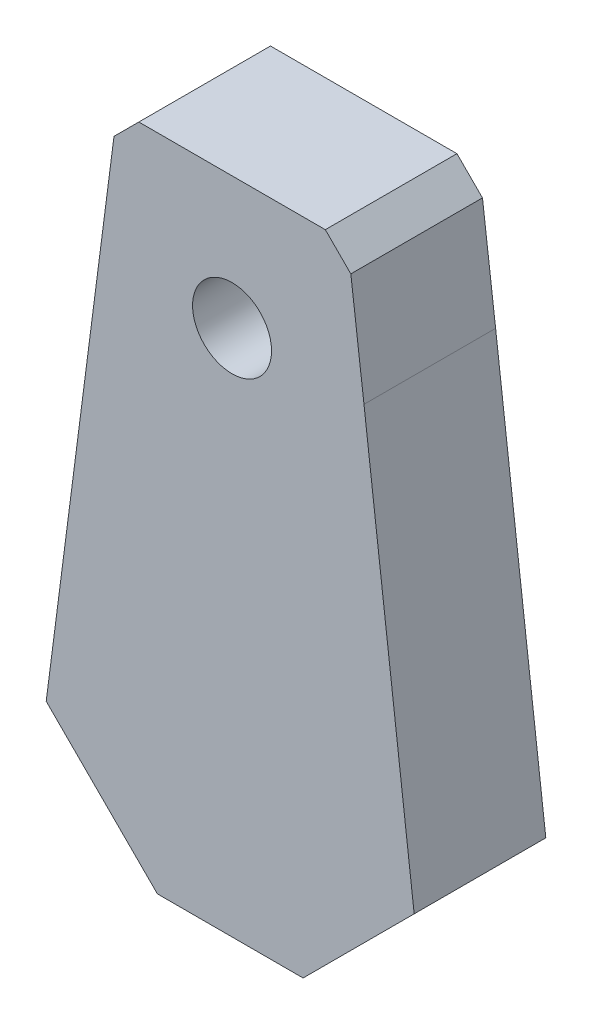
ISO-10303-21;
HEADER;
FILE_DESCRIPTION(('STEP AP214'),'2;1');
FILE_NAME('part.step','',(''),(''),'','','');
FILE_SCHEMA(('AUTOMOTIVE_DESIGN { 1 0 10303 214 1 1 1 1 }'));
ENDSEC;
DATA;
#1=APPLICATION_CONTEXT('core data for automotive mechanical design processes');
#2=APPLICATION_PROTOCOL_DEFINITION('international standard','automotive_design',2000,#1);
#3=PRODUCT_CONTEXT('',#1,'mechanical');
#4=PRODUCT('Part','Part','',(#3));
#5=PRODUCT_RELATED_PRODUCT_CATEGORY('part','',(#4));
#6=PRODUCT_DEFINITION_FORMATION('','',#4);
#7=PRODUCT_DEFINITION_CONTEXT('part definition',#1,'design');
#8=PRODUCT_DEFINITION('design','',#6,#7);
#9=PRODUCT_DEFINITION_SHAPE('','',#8);
#10=(LENGTH_UNIT() NAMED_UNIT(*) SI_UNIT(.MILLI.,.METRE.));
#11=(NAMED_UNIT(*) PLANE_ANGLE_UNIT() SI_UNIT($,.RADIAN.));
#12=(NAMED_UNIT(*) SI_UNIT($,.STERADIAN.) SOLID_ANGLE_UNIT());
#13=UNCERTAINTY_MEASURE_WITH_UNIT(LENGTH_MEASURE(1.E-05),#10,'distance_accuracy_value','');
#14=(GEOMETRIC_REPRESENTATION_CONTEXT(3) GLOBAL_UNCERTAINTY_ASSIGNED_CONTEXT((#13)) GLOBAL_UNIT_ASSIGNED_CONTEXT((#10,
#11,#12)) REPRESENTATION_CONTEXT('',''));
#15=CARTESIAN_POINT('',(0.,0.,0.));
#16=DIRECTION('',(0.,0.,1.));
#17=DIRECTION('',(1.,0.,0.));
#18=AXIS2_PLACEMENT_3D('',#15,#16,#17);
#19=CARTESIAN_POINT('',(0.,0.,6.));
#20=DIRECTION('',(0.,0.,1.));
#21=DIRECTION('',(1.,0.,0.));
#22=AXIS2_PLACEMENT_3D('',#19,#20,#21);
#23=PLANE('',#22);
#24=DIRECTION('',(0.707106781186522,-0.707106781186573,0.));
#25=VECTOR('',#24,1.);
#26=CARTESIAN_POINT('',(31.6082044097566,16.6272850713483,6.));
#27=LINE('',#26,#25);
#28=CARTESIAN_POINT('',(31.6082044097566,16.6272850713483,6.));
#29=VERTEX_POINT('',#28);
#30=CARTESIAN_POINT('',(36.676362522401,11.5591269587035,6.));
#31=VERTEX_POINT('',#30);
#32=EDGE_CURVE('E158',#29,#31,#27,.T.);
#33=ORIENTED_EDGE('',*,*,#32,.T.);
#34=DIRECTION('',(1.,0.,0.));
#35=VECTOR('',#34,1.);
#36=CARTESIAN_POINT('',(36.676362522401,11.5591269587035,6.));
#37=LINE('',#36,#35);
#38=CARTESIAN_POINT('',(43.3183112980604,11.5591269587035,6.));
#39=VERTEX_POINT('',#38);
#40=EDGE_CURVE('E101',#31,#39,#37,.T.);
#41=ORIENTED_EDGE('',*,*,#40,.T.);
#42=DIRECTION('',(0.707106781186545,0.70710678118655,0.));
#43=VECTOR('',#42,1.);
#44=CARTESIAN_POINT('',(43.3183112980604,11.5591269587035,6.));
#45=LINE('',#44,#43);
#46=CARTESIAN_POINT('',(48.3811768100045,16.6219924706477,6.));
#47=VERTEX_POINT('',#46);
#48=EDGE_CURVE('E176',#39,#47,#45,.T.);
#49=ORIENTED_EDGE('',*,*,#48,.T.);
#50=DIRECTION('',(-0.119742895427598,0.992804935017255,0.));
#51=VECTOR('',#50,1.);
#52=CARTESIAN_POINT('',(48.3811768100045,16.6219924706477,6.));
#53=LINE('',#52,#51);
#54=CARTESIAN_POINT('',(46.0931658407384,35.5922083949361,6.));
#55=VERTEX_POINT('',#54);
#56=EDGE_CURVE('E193',#47,#55,#53,.T.);
#57=ORIENTED_EDGE('',*,*,#56,.T.);
#58=DIRECTION('',(-0.122538044035396,0.992463816853783,0.));
#59=VECTOR('',#58,1.);
#60=CARTESIAN_POINT('',(46.0931658407384,35.5922083949361,6.));
#61=LINE('',#60,#59);
#62=CARTESIAN_POINT('',(45.4943315746147,40.4423049188227,6.));
#63=VERTEX_POINT('',#62);
#64=EDGE_CURVE('E192',#55,#63,#61,.T.);
#65=ORIENTED_EDGE('',*,*,#64,.T.);
#66=DIRECTION('',(-0.707106781186537,0.707106781186558,0.));
#67=VECTOR('',#66,1.);
#68=CARTESIAN_POINT('',(44.330954819413,41.6056816740244,6.));
#69=LINE('',#68,#67);
#70=CARTESIAN_POINT('',(44.330954819413,41.6056816740244,6.));
#71=VERTEX_POINT('',#70);
#72=EDGE_CURVE('E123',#63,#71,#69,.T.);
#73=ORIENTED_EDGE('',*,*,#72,.T.);
#74=DIRECTION('',(-1.,0.,0.));
#75=VECTOR('',#74,1.);
#76=CARTESIAN_POINT('',(44.330954819413,41.6056816740244,6.));
#77=LINE('',#76,#75);
#78=CARTESIAN_POINT('',(35.830954819413,41.6056816740244,6.));
#79=VERTEX_POINT('',#78);
#80=EDGE_CURVE('E117',#71,#79,#77,.T.);
#81=ORIENTED_EDGE('',*,*,#80,.T.);
#82=DIRECTION('',(-0.707106781186543,-0.707106781186552,0.));
#83=VECTOR('',#82,1.);
#84=CARTESIAN_POINT('',(34.6988913902548,40.4736182448662,6.));
#85=LINE('',#84,#83);
#86=CARTESIAN_POINT('',(34.6988913902548,40.4736182448662,6.));
#87=VERTEX_POINT('',#86);
#88=EDGE_CURVE('E121',#79,#87,#85,.T.);
#89=ORIENTED_EDGE('',*,*,#88,.T.);
#90=DIRECTION('',(-0.12853340039687,-0.991705180475739,0.));
#91=VECTOR('',#90,1.);
#92=CARTESIAN_POINT('',(31.6082044097566,16.6272850713483,6.));
#93=LINE('',#92,#91);
#94=EDGE_CURVE('E55',#87,#29,#93,.T.);
#95=ORIENTED_EDGE('',*,*,#94,.T.);
#96=EDGE_LOOP('',(#33,#41,#49,#57,#65,#73,#81,#89,#95));
#97=FACE_BOUND('',#96,.T.);
#98=CARTESIAN_POINT('',(40.0796925616497,35.5922083949362,6.));
#99=DIRECTION('',(0.,0.,1.));
#100=DIRECTION('',(1.,0.,0.));
#101=AXIS2_PLACEMENT_3D('',#98,#99,#100);
#102=CIRCLE('',#101,1.8);
#103=CARTESIAN_POINT('',(41.8796925616497,35.5922083949362,6.));
#104=VERTEX_POINT('',#103);
#105=EDGE_CURVE('E145',#104,#104,#102,.T.);
#106=ORIENTED_EDGE('',*,*,#105,.F.);
#107=EDGE_LOOP('',(#106));
#108=FACE_BOUND('',#107,.T.);
#109=ADVANCED_FACE('F38',(#97,#108),#23,.T.);
#110=CARTESIAN_POINT('',(0.,0.,0.));
#111=DIRECTION('',(0.,0.,1.));
#112=DIRECTION('',(1.,0.,0.));
#113=AXIS2_PLACEMENT_3D('',#110,#111,#112);
#114=PLANE('',#113);
#115=DIRECTION('',(0.707106781186522,-0.707106781186573,0.));
#116=VECTOR('',#115,1.);
#117=CARTESIAN_POINT('',(31.6082044097566,16.6272850713483,0.));
#118=LINE('',#117,#116);
#119=CARTESIAN_POINT('',(31.6082044097566,16.6272850713483,0.));
#120=VERTEX_POINT('',#119);
#121=CARTESIAN_POINT('',(36.676362522401,11.5591269587035,0.));
#122=VERTEX_POINT('',#121);
#123=EDGE_CURVE('E141',#120,#122,#118,.T.);
#124=ORIENTED_EDGE('',*,*,#123,.F.);
#125=DIRECTION('',(-0.12853340039687,-0.991705180475739,0.));
#126=VECTOR('',#125,1.);
#127=CARTESIAN_POINT('',(31.6082044097566,16.6272850713483,0.));
#128=LINE('',#127,#126);
#129=CARTESIAN_POINT('',(34.6988913902548,40.4736182448662,0.));
#130=VERTEX_POINT('',#129);
#131=EDGE_CURVE('E93',#130,#120,#128,.T.);
#132=ORIENTED_EDGE('',*,*,#131,.F.);
#133=DIRECTION('',(-0.707106781186543,-0.707106781186552,0.));
#134=VECTOR('',#133,1.);
#135=CARTESIAN_POINT('',(34.6988913902548,40.4736182448662,0.));
#136=LINE('',#135,#134);
#137=CARTESIAN_POINT('',(35.830954819413,41.6056816740244,0.));
#138=VERTEX_POINT('',#137);
#139=EDGE_CURVE('E87',#138,#130,#136,.T.);
#140=ORIENTED_EDGE('',*,*,#139,.F.);
#141=DIRECTION('',(-1.,0.,0.));
#142=VECTOR('',#141,1.);
#143=CARTESIAN_POINT('',(44.330954819413,41.6056816740244,0.));
#144=LINE('',#143,#142);
#145=CARTESIAN_POINT('',(44.330954819413,41.6056816740244,0.));
#146=VERTEX_POINT('',#145);
#147=EDGE_CURVE('E131',#146,#138,#144,.T.);
#148=ORIENTED_EDGE('',*,*,#147,.F.);
#149=DIRECTION('',(-0.707106781186537,0.707106781186558,0.));
#150=VECTOR('',#149,1.);
#151=CARTESIAN_POINT('',(44.330954819413,41.6056816740244,0.));
#152=LINE('',#151,#150);
#153=CARTESIAN_POINT('',(45.4943315746147,40.4423049188227,0.));
#154=VERTEX_POINT('',#153);
#155=EDGE_CURVE('E153',#154,#146,#152,.T.);
#156=ORIENTED_EDGE('',*,*,#155,.F.);
#157=DIRECTION('',(-0.122538044035396,0.992463816853783,0.));
#158=VECTOR('',#157,1.);
#159=CARTESIAN_POINT('',(46.0931658407384,35.5922083949361,0.));
#160=LINE('',#159,#158);
#161=CARTESIAN_POINT('',(46.0931658407384,35.5922083949361,0.));
#162=VERTEX_POINT('',#161);
#163=EDGE_CURVE('E151',#162,#154,#160,.T.);
#164=ORIENTED_EDGE('',*,*,#163,.F.);
#165=DIRECTION('',(-0.119742895427598,0.992804935017255,0.));
#166=VECTOR('',#165,1.);
#167=CARTESIAN_POINT('',(48.3811768100045,16.6219924706477,0.));
#168=LINE('',#167,#166);
#169=CARTESIAN_POINT('',(48.3811768100045,16.6219924706477,0.));
#170=VERTEX_POINT('',#169);
#171=EDGE_CURVE('E149',#170,#162,#168,.T.);
#172=ORIENTED_EDGE('',*,*,#171,.F.);
#173=DIRECTION('',(0.707106781186545,0.70710678118655,0.));
#174=VECTOR('',#173,1.);
#175=CARTESIAN_POINT('',(43.3183112980604,11.5591269587035,0.));
#176=LINE('',#175,#174);
#177=CARTESIAN_POINT('',(43.3183112980604,11.5591269587035,0.));
#178=VERTEX_POINT('',#177);
#179=EDGE_CURVE('E147',#178,#170,#176,.T.);
#180=ORIENTED_EDGE('',*,*,#179,.F.);
#181=DIRECTION('',(1.,0.,0.));
#182=VECTOR('',#181,1.);
#183=CARTESIAN_POINT('',(36.676362522401,11.5591269587035,0.));
#184=LINE('',#183,#182);
#185=EDGE_CURVE('E144',#122,#178,#184,.T.);
#186=ORIENTED_EDGE('',*,*,#185,.F.);
#187=EDGE_LOOP('',(#124,#132,#140,#148,#156,#164,#172,#180,#186));
#188=FACE_BOUND('',#187,.T.);
#189=CARTESIAN_POINT('',(40.0796925616497,35.5922083949362,0.));
#190=DIRECTION('',(0.,0.,1.));
#191=DIRECTION('',(1.,0.,0.));
#192=AXIS2_PLACEMENT_3D('',#189,#190,#191);
#193=CIRCLE('',#192,1.8);
#194=CARTESIAN_POINT('',(41.8796925616497,35.5922083949362,0.));
#195=VERTEX_POINT('',#194);
#196=EDGE_CURVE('E200',#195,#195,#193,.T.);
#197=ORIENTED_EDGE('',*,*,#196,.T.);
#198=EDGE_LOOP('',(#197));
#199=FACE_BOUND('',#198,.T.);
#200=ADVANCED_FACE('F180',(#188,#199),#114,.F.);
#201=CARTESIAN_POINT('',(31.6082044097566,16.6272850713483,6.));
#202=DIRECTION('',(0.707106781186573,0.707106781186522,0.));
#203=DIRECTION('',(-0.707106781186522,0.707106781186573,0.));
#204=AXIS2_PLACEMENT_3D('',#201,#202,#203);
#205=PLANE('',#204);
#206=ORIENTED_EDGE('',*,*,#123,.T.);
#207=DIRECTION('',(0.,0.,-1.));
#208=VECTOR('',#207,1.);
#209=CARTESIAN_POINT('',(36.676362522401,11.5591269587035,6.));
#210=LINE('',#209,#208);
#211=EDGE_CURVE('E11',#31,#122,#210,.T.);
#212=ORIENTED_EDGE('',*,*,#211,.F.);
#213=ORIENTED_EDGE('',*,*,#32,.F.);
#214=DIRECTION('',(0.,0.,-1.));
#215=VECTOR('',#214,1.);
#216=CARTESIAN_POINT('',(31.6082044097566,16.6272850713483,6.));
#217=LINE('',#216,#215);
#218=EDGE_CURVE('E137',#29,#120,#217,.T.);
#219=ORIENTED_EDGE('',*,*,#218,.T.);
#220=EDGE_LOOP('',(#206,#212,#213,#219));
#221=FACE_BOUND('',#220,.T.);
#222=ADVANCED_FACE('F40',(#221),#205,.F.);
#223=CARTESIAN_POINT('',(36.676362522401,11.5591269587035,6.));
#224=DIRECTION('',(0.,1.,0.));
#225=DIRECTION('',(0.,0.,1.));
#226=AXIS2_PLACEMENT_3D('',#223,#224,#225);
#227=PLANE('',#226);
#228=ORIENTED_EDGE('',*,*,#185,.T.);
#229=DIRECTION('',(0.,0.,-1.));
#230=VECTOR('',#229,1.);
#231=CARTESIAN_POINT('',(43.3183112980604,11.5591269587035,6.));
#232=LINE('',#231,#230);
#233=EDGE_CURVE('E47',#39,#178,#232,.T.);
#234=ORIENTED_EDGE('',*,*,#233,.F.);
#235=ORIENTED_EDGE('',*,*,#40,.F.);
#236=ORIENTED_EDGE('',*,*,#211,.T.);
#237=EDGE_LOOP('',(#228,#234,#235,#236));
#238=FACE_BOUND('',#237,.T.);
#239=ADVANCED_FACE('F231',(#238),#227,.F.);
#240=CARTESIAN_POINT('',(43.3183112980604,11.5591269587035,6.));
#241=DIRECTION('',(-0.70710678118655,0.707106781186545,0.));
#242=DIRECTION('',(-0.707106781186545,-0.70710678118655,0.));
#243=AXIS2_PLACEMENT_3D('',#240,#241,#242);
#244=PLANE('',#243);
#245=ORIENTED_EDGE('',*,*,#179,.T.);
#246=DIRECTION('',(0.,0.,-1.));
#247=VECTOR('',#246,1.);
#248=CARTESIAN_POINT('',(48.3811768100045,16.6219924706477,6.));
#249=LINE('',#248,#247);
#250=EDGE_CURVE('E168',#47,#170,#249,.T.);
#251=ORIENTED_EDGE('',*,*,#250,.F.);
#252=ORIENTED_EDGE('',*,*,#48,.F.);
#253=ORIENTED_EDGE('',*,*,#233,.T.);
#254=EDGE_LOOP('',(#245,#251,#252,#253));
#255=FACE_BOUND('',#254,.T.);
#256=ADVANCED_FACE('F174',(#255),#244,.F.);
#257=CARTESIAN_POINT('',(48.3811768100045,16.6219924706477,6.));
#258=DIRECTION('',(-0.992804935017255,-0.119742895427598,0.));
#259=DIRECTION('',(0.119742895427598,-0.992804935017255,0.));
#260=AXIS2_PLACEMENT_3D('',#257,#258,#259);
#261=PLANE('',#260);
#262=ORIENTED_EDGE('',*,*,#171,.T.);
#263=DIRECTION('',(0.,0.,-1.));
#264=VECTOR('',#263,1.);
#265=CARTESIAN_POINT('',(46.0931658407384,35.5922083949361,6.));
#266=LINE('',#265,#264);
#267=EDGE_CURVE('E165',#55,#162,#266,.T.);
#268=ORIENTED_EDGE('',*,*,#267,.F.);
#269=ORIENTED_EDGE('',*,*,#56,.F.);
#270=ORIENTED_EDGE('',*,*,#250,.T.);
#271=EDGE_LOOP('',(#262,#268,#269,#270));
#272=FACE_BOUND('',#271,.T.);
#273=ADVANCED_FACE('F186',(#272),#261,.F.);
#274=CARTESIAN_POINT('',(46.0931658407384,35.5922083949361,6.));
#275=DIRECTION('',(-0.992463816853783,-0.122538044035396,0.));
#276=DIRECTION('',(0.122538044035396,-0.992463816853783,0.));
#277=AXIS2_PLACEMENT_3D('',#274,#275,#276);
#278=PLANE('',#277);
#279=ORIENTED_EDGE('',*,*,#163,.T.);
#280=DIRECTION('',(0.,0.,-1.));
#281=VECTOR('',#280,1.);
#282=CARTESIAN_POINT('',(45.4943315746147,40.4423049188227,6.));
#283=LINE('',#282,#281);
#284=EDGE_CURVE('E162',#63,#154,#283,.T.);
#285=ORIENTED_EDGE('',*,*,#284,.F.);
#286=ORIENTED_EDGE('',*,*,#64,.F.);
#287=ORIENTED_EDGE('',*,*,#267,.T.);
#288=EDGE_LOOP('',(#279,#285,#286,#287));
#289=FACE_BOUND('',#288,.T.);
#290=ADVANCED_FACE('F190',(#289),#278,.F.);
#291=CARTESIAN_POINT('',(44.330954819413,41.6056816740244,6.));
#292=DIRECTION('',(-0.707106781186558,-0.707106781186537,0.));
#293=DIRECTION('',(0.707106781186537,-0.707106781186558,0.));
#294=AXIS2_PLACEMENT_3D('',#291,#292,#293);
#295=PLANE('',#294);
#296=ORIENTED_EDGE('',*,*,#155,.T.);
#297=DIRECTION('',(0.,0.,-1.));
#298=VECTOR('',#297,1.);
#299=CARTESIAN_POINT('',(44.330954819413,41.6056816740244,6.));
#300=LINE('',#299,#298);
#301=EDGE_CURVE('E132',#71,#146,#300,.T.);
#302=ORIENTED_EDGE('',*,*,#301,.F.);
#303=ORIENTED_EDGE('',*,*,#72,.F.);
#304=ORIENTED_EDGE('',*,*,#284,.T.);
#305=EDGE_LOOP('',(#296,#302,#303,#304));
#306=FACE_BOUND('',#305,.T.);
#307=ADVANCED_FACE('F222',(#306),#295,.F.);
#308=CARTESIAN_POINT('',(44.330954819413,41.6056816740244,6.));
#309=DIRECTION('',(0.,-1.,0.));
#310=DIRECTION('',(0.,0.,-1.));
#311=AXIS2_PLACEMENT_3D('',#308,#309,#310);
#312=PLANE('',#311);
#313=ORIENTED_EDGE('',*,*,#147,.T.);
#314=DIRECTION('',(0.,0.,-1.));
#315=VECTOR('',#314,1.);
#316=CARTESIAN_POINT('',(35.830954819413,41.6056816740244,6.));
#317=LINE('',#316,#315);
#318=EDGE_CURVE('E128',#79,#138,#317,.T.);
#319=ORIENTED_EDGE('',*,*,#318,.F.);
#320=ORIENTED_EDGE('',*,*,#80,.F.);
#321=ORIENTED_EDGE('',*,*,#301,.T.);
#322=EDGE_LOOP('',(#313,#319,#320,#321));
#323=FACE_BOUND('',#322,.T.);
#324=ADVANCED_FACE('F129',(#323),#312,.F.);
#325=CARTESIAN_POINT('',(34.6988913902548,40.4736182448662,6.));
#326=DIRECTION('',(0.707106781186552,-0.707106781186543,0.));
#327=DIRECTION('',(0.707106781186543,0.707106781186552,0.));
#328=AXIS2_PLACEMENT_3D('',#325,#326,#327);
#329=PLANE('',#328);
#330=ORIENTED_EDGE('',*,*,#139,.T.);
#331=DIRECTION('',(0.,0.,-1.));
#332=VECTOR('',#331,1.);
#333=CARTESIAN_POINT('',(34.6988913902548,40.4736182448662,6.));
#334=LINE('',#333,#332);
#335=EDGE_CURVE('E133',#87,#130,#334,.T.);
#336=ORIENTED_EDGE('',*,*,#335,.F.);
#337=ORIENTED_EDGE('',*,*,#88,.F.);
#338=ORIENTED_EDGE('',*,*,#318,.T.);
#339=EDGE_LOOP('',(#330,#336,#337,#338));
#340=FACE_BOUND('',#339,.T.);
#341=ADVANCED_FACE('F135',(#340),#329,.F.);
#342=CARTESIAN_POINT('',(31.6082044097566,16.6272850713483,6.));
#343=DIRECTION('',(0.991705180475739,-0.12853340039687,0.));
#344=DIRECTION('',(0.12853340039687,0.991705180475739,0.));
#345=AXIS2_PLACEMENT_3D('',#342,#343,#344);
#346=PLANE('',#345);
#347=ORIENTED_EDGE('',*,*,#131,.T.);
#348=ORIENTED_EDGE('',*,*,#218,.F.);
#349=ORIENTED_EDGE('',*,*,#94,.F.);
#350=ORIENTED_EDGE('',*,*,#335,.T.);
#351=EDGE_LOOP('',(#347,#348,#349,#350));
#352=FACE_BOUND('',#351,.T.);
#353=ADVANCED_FACE('F215',(#352),#346,.F.);
#354=CARTESIAN_POINT('',(40.0796925616497,35.5922083949362,6.));
#355=DIRECTION('',(0.,0.,-1.));
#356=DIRECTION('',(-1.,0.,0.));
#357=AXIS2_PLACEMENT_3D('',#354,#355,#356);
#358=CYLINDRICAL_SURFACE('',#357,1.8);
#359=ORIENTED_EDGE('',*,*,#105,.T.);
#360=EDGE_LOOP('',(#359));
#361=FACE_BOUND('',#360,.T.);
#362=ORIENTED_EDGE('',*,*,#196,.F.);
#363=EDGE_LOOP('',(#362));
#364=FACE_BOUND('',#363,.T.);
#365=ADVANCED_FACE('F206',(#361,#364),#358,.F.);
#366=CLOSED_SHELL('',(#109,#200,#222,#239,#256,#273,#290,#307,#324,#341,#353,#365));
#367=MANIFOLD_SOLID_BREP('B2',#366);
#368=ADVANCED_BREP_SHAPE_REPRESENTATION('',(#18,#367),#14);
#369=SHAPE_DEFINITION_REPRESENTATION(#9,#368);
ENDSEC;
END-ISO-10303-21;
